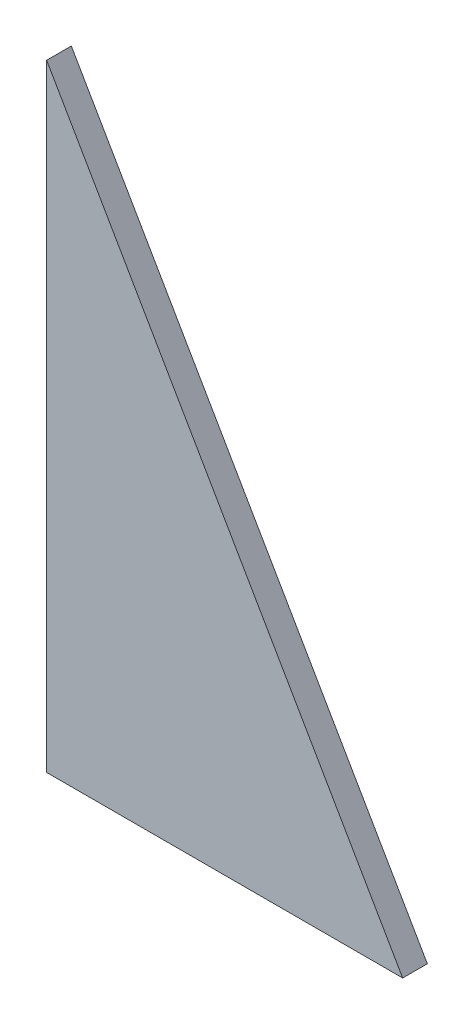
ISO-10303-21;
HEADER;
FILE_DESCRIPTION(('STEP AP214'),'2;1');
FILE_NAME('part.step','',(''),(''),'','','');
FILE_SCHEMA(('AUTOMOTIVE_DESIGN { 1 0 10303 214 1 1 1 1 }'));
ENDSEC;
DATA;
#1=APPLICATION_CONTEXT('core data for automotive mechanical design processes');
#2=APPLICATION_PROTOCOL_DEFINITION('international standard','automotive_design',2000,#1);
#3=PRODUCT_CONTEXT('',#1,'mechanical');
#4=PRODUCT('Part','Part','',(#3));
#5=PRODUCT_RELATED_PRODUCT_CATEGORY('part','',(#4));
#6=PRODUCT_DEFINITION_FORMATION('','',#4);
#7=PRODUCT_DEFINITION_CONTEXT('part definition',#1,'design');
#8=PRODUCT_DEFINITION('design','',#6,#7);
#9=PRODUCT_DEFINITION_SHAPE('','',#8);
#10=(LENGTH_UNIT() NAMED_UNIT(*) SI_UNIT(.MILLI.,.METRE.));
#11=(NAMED_UNIT(*) PLANE_ANGLE_UNIT() SI_UNIT($,.RADIAN.));
#12=(NAMED_UNIT(*) SI_UNIT($,.STERADIAN.) SOLID_ANGLE_UNIT());
#13=UNCERTAINTY_MEASURE_WITH_UNIT(LENGTH_MEASURE(1.E-05),#10,'distance_accuracy_value','');
#14=(GEOMETRIC_REPRESENTATION_CONTEXT(3) GLOBAL_UNCERTAINTY_ASSIGNED_CONTEXT((#13)) GLOBAL_UNIT_ASSIGNED_CONTEXT((#10,
#11,#12)) REPRESENTATION_CONTEXT('',''));
#15=CARTESIAN_POINT('',(0.,0.,0.));
#16=DIRECTION('',(0.,0.,1.));
#17=DIRECTION('',(1.,0.,0.));
#18=AXIS2_PLACEMENT_3D('',#15,#16,#17);
#19=CARTESIAN_POINT('',(0.,0.,2.54));
#20=DIRECTION('',(1.,0.,0.));
#21=DIRECTION('',(0.,0.,-1.));
#22=AXIS2_PLACEMENT_3D('',#19,#20,#21);
#23=PLANE('',#22);
#24=DIRECTION('',(0.,1.,0.));
#25=VECTOR('',#24,1.);
#26=CARTESIAN_POINT('',(0.,31.75,2.032));
#27=LINE('',#26,#25);
#28=CARTESIAN_POINT('',(0.,28.194,2.032));
#29=VERTEX_POINT('',#28);
#30=CARTESIAN_POINT('',(0.,35.306,2.032));
#31=VERTEX_POINT('',#30);
#32=EDGE_CURVE('E224',#29,#31,#27,.T.);
#33=ORIENTED_EDGE('',*,*,#32,.F.);
#34=DIRECTION('',(0.,0.,-1.));
#35=VECTOR('',#34,1.);
#36=CARTESIAN_POINT('',(0.,28.194,2.032));
#37=LINE('',#36,#35);
#38=CARTESIAN_POINT('',(0.,28.194,0.));
#39=VERTEX_POINT('',#38);
#40=EDGE_CURVE('E235',#29,#39,#37,.T.);
#41=ORIENTED_EDGE('',*,*,#40,.T.);
#42=DIRECTION('',(0.,-1.,0.));
#43=VECTOR('',#42,1.);
#44=CARTESIAN_POINT('',(0.,0.,0.));
#45=LINE('',#44,#43);
#46=CARTESIAN_POINT('',(0.,0.,0.));
#47=VERTEX_POINT('',#46);
#48=EDGE_CURVE('E222',#39,#47,#45,.T.);
#49=ORIENTED_EDGE('',*,*,#48,.T.);
#50=DIRECTION('',(0.,0.,-1.));
#51=VECTOR('',#50,1.);
#52=CARTESIAN_POINT('',(0.,0.,2.54));
#53=LINE('',#52,#51);
#54=CARTESIAN_POINT('',(0.,0.,2.54));
#55=VERTEX_POINT('',#54);
#56=EDGE_CURVE('E268',#55,#47,#53,.T.);
#57=ORIENTED_EDGE('',*,*,#56,.F.);
#58=DIRECTION('',(0.,-1.,0.));
#59=VECTOR('',#58,1.);
#60=CARTESIAN_POINT('',(0.,0.,2.54));
#61=LINE('',#60,#59);
#62=CARTESIAN_POINT('',(0.,63.5,2.54));
#63=VERTEX_POINT('',#62);
#64=EDGE_CURVE('E241',#63,#55,#61,.T.);
#65=ORIENTED_EDGE('',*,*,#64,.F.);
#66=DIRECTION('',(0.,0.,-1.));
#67=VECTOR('',#66,1.);
#68=CARTESIAN_POINT('',(0.,63.5,2.54));
#69=LINE('',#68,#67);
#70=CARTESIAN_POINT('',(0.,63.5,0.));
#71=VERTEX_POINT('',#70);
#72=EDGE_CURVE('E252',#63,#71,#69,.T.);
#73=ORIENTED_EDGE('',*,*,#72,.T.);
#74=CARTESIAN_POINT('',(0.,35.306,0.));
#75=VERTEX_POINT('',#74);
#76=EDGE_CURVE('E253',#71,#75,#45,.T.);
#77=ORIENTED_EDGE('',*,*,#76,.T.);
#78=DIRECTION('',(0.,0.,-1.));
#79=VECTOR('',#78,1.);
#80=CARTESIAN_POINT('',(0.,35.306,2.032));
#81=LINE('',#80,#79);
#82=EDGE_CURVE('E237',#31,#75,#81,.T.);
#83=ORIENTED_EDGE('',*,*,#82,.F.);
#84=EDGE_LOOP('',(#33,#41,#49,#57,#65,#73,#77,#83));
#85=FACE_BOUND('',#84,.T.);
#86=ADVANCED_FACE('F38',(#85),#23,.F.);
#87=CARTESIAN_POINT('',(0.,0.,2.54));
#88=DIRECTION('',(0.,1.,0.));
#89=DIRECTION('',(0.,0.,1.));
#90=AXIS2_PLACEMENT_3D('',#87,#88,#89);
#91=PLANE('',#90);
#92=DIRECTION('',(1.,0.,0.));
#93=VECTOR('',#92,1.);
#94=CARTESIAN_POINT('',(0.,0.,0.));
#95=LINE('',#94,#93);
#96=CARTESIAN_POINT('',(36.6522,0.,0.));
#97=VERTEX_POINT('',#96);
#98=EDGE_CURVE('E257',#47,#97,#95,.T.);
#99=ORIENTED_EDGE('',*,*,#98,.T.);
#100=DIRECTION('',(0.,0.,-1.));
#101=VECTOR('',#100,1.);
#102=CARTESIAN_POINT('',(36.6522,0.,2.54));
#103=LINE('',#102,#101);
#104=CARTESIAN_POINT('',(36.6522,0.,2.54));
#105=VERTEX_POINT('',#104);
#106=EDGE_CURVE('E265',#105,#97,#103,.T.);
#107=ORIENTED_EDGE('',*,*,#106,.F.);
#108=DIRECTION('',(1.,0.,0.));
#109=VECTOR('',#108,1.);
#110=CARTESIAN_POINT('',(0.,0.,2.54));
#111=LINE('',#110,#109);
#112=EDGE_CURVE('E245',#55,#105,#111,.T.);
#113=ORIENTED_EDGE('',*,*,#112,.F.);
#114=ORIENTED_EDGE('',*,*,#56,.T.);
#115=EDGE_LOOP('',(#99,#107,#113,#114));
#116=FACE_BOUND('',#115,.T.);
#117=ADVANCED_FACE('F433',(#116),#91,.F.);
#118=CARTESIAN_POINT('',(0.,63.5,2.54));
#119=DIRECTION('',(-0.866081752896378,-0.49990238777179,0.));
#120=DIRECTION('',(0.49990238777179,-0.866081752896378,0.));
#121=AXIS2_PLACEMENT_3D('',#118,#119,#120);
#122=PLANE('',#121);
#123=DIRECTION('',(-0.49990238777179,0.866081752896378,0.));
#124=VECTOR('',#123,1.);
#125=CARTESIAN_POINT('',(0.,63.5,0.));
#126=LINE('',#125,#124);
#127=EDGE_CURVE('E246',#97,#71,#126,.T.);
#128=ORIENTED_EDGE('',*,*,#127,.T.);
#129=ORIENTED_EDGE('',*,*,#72,.F.);
#130=DIRECTION('',(-0.49990238777179,0.866081752896378,0.));
#131=VECTOR('',#130,1.);
#132=CARTESIAN_POINT('',(0.,63.5,2.54));
#133=LINE('',#132,#131);
#134=EDGE_CURVE('E249',#105,#63,#133,.T.);
#135=ORIENTED_EDGE('',*,*,#134,.F.);
#136=ORIENTED_EDGE('',*,*,#106,.T.);
#137=EDGE_LOOP('',(#128,#129,#135,#136));
#138=FACE_BOUND('',#137,.T.);
#139=ADVANCED_FACE('F437',(#138),#122,.F.);
#140=CARTESIAN_POINT('',(0.,0.,2.54));
#141=DIRECTION('',(0.,0.,-1.));
#142=DIRECTION('',(-1.,0.,0.));
#143=AXIS2_PLACEMENT_3D('',#140,#141,#142);
#144=PLANE('',#143);
#145=ORIENTED_EDGE('',*,*,#64,.T.);
#146=ORIENTED_EDGE('',*,*,#112,.T.);
#147=ORIENTED_EDGE('',*,*,#134,.T.);
#148=EDGE_LOOP('',(#145,#146,#147));
#149=FACE_BOUND('',#148,.T.);
#150=ADVANCED_FACE('F443',(#149),#144,.F.);
#151=CARTESIAN_POINT('',(0.,0.,0.));
#152=DIRECTION('',(0.,0.,-1.));
#153=DIRECTION('',(-1.,0.,0.));
#154=AXIS2_PLACEMENT_3D('',#151,#152,#153);
#155=PLANE('',#154);
#156=DIRECTION('',(0.,1.,0.));
#157=VECTOR('',#156,1.);
#158=CARTESIAN_POINT('',(2.54,31.75,0.));
#159=LINE('',#158,#157);
#160=CARTESIAN_POINT('',(2.54,22.5425,0.));
#161=VERTEX_POINT('',#160);
#162=CARTESIAN_POINT('',(2.54,28.194,0.));
#163=VERTEX_POINT('',#162);
#164=EDGE_CURVE('E194',#161,#163,#159,.T.);
#165=ORIENTED_EDGE('',*,*,#164,.F.);
#166=CARTESIAN_POINT('',(4.1275,22.5425,0.));
#167=DIRECTION('',(0.,0.,-1.));
#168=DIRECTION('',(-1.,0.,0.));
#169=AXIS2_PLACEMENT_3D('',#166,#167,#168);
#170=CIRCLE('',#169,1.5875);
#171=CARTESIAN_POINT('',(4.1275,20.955,0.));
#172=VERTEX_POINT('',#171);
#173=EDGE_CURVE('E330',#161,#172,#170,.F.);
#174=ORIENTED_EDGE('',*,*,#173,.T.);
#175=DIRECTION('',(-1.,0.,0.));
#176=VECTOR('',#175,1.);
#177=CARTESIAN_POINT('',(2.54,20.955,0.));
#178=LINE('',#177,#176);
#179=CARTESIAN_POINT('',(16.5666651598498,20.955,0.));
#180=VERTEX_POINT('',#179);
#181=EDGE_CURVE('E353',#180,#172,#178,.T.);
#182=ORIENTED_EDGE('',*,*,#181,.F.);
#183=CARTESIAN_POINT('',(16.5666651598498,22.5425,0.));
#184=DIRECTION('',(0.,0.,-1.));
#185=DIRECTION('',(-1.,0.,0.));
#186=AXIS2_PLACEMENT_3D('',#183,#184,#185);
#187=CIRCLE('',#186,1.5875);
#188=CARTESIAN_POINT('',(17.9415699425728,23.3360950405877,0.));
#189=VERTEX_POINT('',#188);
#190=EDGE_CURVE('E338',#180,#189,#187,.F.);
#191=ORIENTED_EDGE('',*,*,#190,.T.);
#192=DIRECTION('',(0.49990238777179,-0.866081752896379,0.));
#193=VECTOR('',#192,1.);
#194=CARTESIAN_POINT('',(6.85419,42.545,0.));
#195=LINE('',#194,#193);
#196=CARTESIAN_POINT('',(7.31243194257277,41.7510950405877,0.));
#197=VERTEX_POINT('',#196);
#198=EDGE_CURVE('E348',#197,#189,#195,.T.);
#199=ORIENTED_EDGE('',*,*,#198,.F.);
#200=CARTESIAN_POINT('',(5.93752715984977,40.9575,0.));
#201=DIRECTION('',(0.,0.,-1.));
#202=DIRECTION('',(-1.,0.,0.));
#203=AXIS2_PLACEMENT_3D('',#200,#201,#202);
#204=CIRCLE('',#203,1.5875);
#205=CARTESIAN_POINT('',(5.93752715984977,42.545,0.));
#206=VERTEX_POINT('',#205);
#207=EDGE_CURVE('E47',#197,#206,#204,.F.);
#208=ORIENTED_EDGE('',*,*,#207,.T.);
#209=DIRECTION('',(1.,0.,0.));
#210=VECTOR('',#209,1.);
#211=CARTESIAN_POINT('',(2.54,42.545,0.));
#212=LINE('',#211,#210);
#213=CARTESIAN_POINT('',(4.1275,42.545,0.));
#214=VERTEX_POINT('',#213);
#215=EDGE_CURVE('E347',#214,#206,#212,.T.);
#216=ORIENTED_EDGE('',*,*,#215,.F.);
#217=CARTESIAN_POINT('',(4.1275,40.9575,0.));
#218=DIRECTION('',(0.,0.,-1.));
#219=DIRECTION('',(-1.,0.,0.));
#220=AXIS2_PLACEMENT_3D('',#217,#218,#219);
#221=CIRCLE('',#220,1.5875);
#222=CARTESIAN_POINT('',(2.54,40.9575,0.));
#223=VERTEX_POINT('',#222);
#224=EDGE_CURVE('E11',#214,#223,#221,.F.);
#225=ORIENTED_EDGE('',*,*,#224,.T.);
#226=CARTESIAN_POINT('',(2.54,35.306,0.));
#227=VERTEX_POINT('',#226);
#228=EDGE_CURVE('E204',#227,#223,#159,.T.);
#229=ORIENTED_EDGE('',*,*,#228,.F.);
#230=DIRECTION('',(1.,0.,0.));
#231=VECTOR('',#230,1.);
#232=CARTESIAN_POINT('',(0.,35.306,0.));
#233=LINE('',#232,#231);
#234=EDGE_CURVE('E217',#75,#227,#233,.T.);
#235=ORIENTED_EDGE('',*,*,#234,.F.);
#236=ORIENTED_EDGE('',*,*,#76,.F.);
#237=ORIENTED_EDGE('',*,*,#127,.F.);
#238=ORIENTED_EDGE('',*,*,#98,.F.);
#239=ORIENTED_EDGE('',*,*,#48,.F.);
#240=DIRECTION('',(-1.,0.,0.));
#241=VECTOR('',#240,1.);
#242=CARTESIAN_POINT('',(0.,28.194,0.));
#243=LINE('',#242,#241);
#244=EDGE_CURVE('E210',#163,#39,#243,.T.);
#245=ORIENTED_EDGE('',*,*,#244,.F.);
#246=EDGE_LOOP('',(#165,#174,#182,#191,#199,#208,#216,#225,#229,#235,#236,#237,#238,#239,#245));
#247=FACE_BOUND('',#246,.T.);
#248=ADVANCED_FACE('F220',(#247),#155,.T.);
#249=CARTESIAN_POINT('',(0.,28.194,2.032));
#250=DIRECTION('',(0.,-1.,0.));
#251=DIRECTION('',(0.,0.,-1.));
#252=AXIS2_PLACEMENT_3D('',#249,#250,#251);
#253=PLANE('',#252);
#254=DIRECTION('',(-1.,0.,0.));
#255=VECTOR('',#254,1.);
#256=CARTESIAN_POINT('',(0.,28.194,2.032));
#257=LINE('',#256,#255);
#258=CARTESIAN_POINT('',(9.08049999999999,28.194,2.032));
#259=VERTEX_POINT('',#258);
#260=EDGE_CURVE('E240',#259,#29,#257,.T.);
#261=ORIENTED_EDGE('',*,*,#260,.F.);
#262=DIRECTION('',(0.,0.,-1.));
#263=VECTOR('',#262,1.);
#264=CARTESIAN_POINT('',(9.08049999999999,28.194,0.9144));
#265=LINE('',#264,#263);
#266=CARTESIAN_POINT('',(9.08049999999999,28.194,0.9144));
#267=VERTEX_POINT('',#266);
#268=EDGE_CURVE('E312',#259,#267,#265,.T.);
#269=ORIENTED_EDGE('',*,*,#268,.T.);
#270=DIRECTION('',(-1.,0.,0.));
#271=VECTOR('',#270,1.);
#272=CARTESIAN_POINT('',(0.,28.194,0.9144));
#273=LINE('',#272,#271);
#274=CARTESIAN_POINT('',(2.54,28.194,0.9144));
#275=VERTEX_POINT('',#274);
#276=EDGE_CURVE('E214',#267,#275,#273,.T.);
#277=ORIENTED_EDGE('',*,*,#276,.T.);
#278=DIRECTION('',(0.,0.,-1.));
#279=VECTOR('',#278,1.);
#280=CARTESIAN_POINT('',(2.54,28.194,2.032));
#281=LINE('',#280,#279);
#282=EDGE_CURVE('E198',#275,#163,#281,.T.);
#283=ORIENTED_EDGE('',*,*,#282,.T.);
#284=ORIENTED_EDGE('',*,*,#244,.T.);
#285=ORIENTED_EDGE('',*,*,#40,.F.);
#286=EDGE_LOOP('',(#261,#269,#277,#283,#284,#285));
#287=FACE_BOUND('',#286,.T.);
#288=ADVANCED_FACE('F208',(#287),#253,.F.);
#289=CARTESIAN_POINT('',(10.668,35.306,2.032));
#290=DIRECTION('',(1.,0.,0.));
#291=DIRECTION('',(0.,1.,0.));
#292=AXIS2_PLACEMENT_3D('',#289,#290,#291);
#293=PLANE('',#292);
#294=DIRECTION('',(0.,-1.,0.));
#295=VECTOR('',#294,1.);
#296=CARTESIAN_POINT('',(10.668,35.306,2.032));
#297=LINE('',#296,#295);
#298=CARTESIAN_POINT('',(10.668,33.7185,2.032));
#299=VERTEX_POINT('',#298);
#300=CARTESIAN_POINT('',(10.668,29.7815,2.032));
#301=VERTEX_POINT('',#300);
#302=EDGE_CURVE('E371',#299,#301,#297,.T.);
#303=ORIENTED_EDGE('',*,*,#302,.F.);
#304=DIRECTION('',(0.,0.,-1.));
#305=VECTOR('',#304,1.);
#306=CARTESIAN_POINT('',(10.668,33.7185,0.9144));
#307=LINE('',#306,#305);
#308=CARTESIAN_POINT('',(10.668,33.7185,0.9144));
#309=VERTEX_POINT('',#308);
#310=EDGE_CURVE('E302',#299,#309,#307,.T.);
#311=ORIENTED_EDGE('',*,*,#310,.T.);
#312=DIRECTION('',(0.,-1.,0.));
#313=VECTOR('',#312,1.);
#314=CARTESIAN_POINT('',(10.668,35.306,0.9144));
#315=LINE('',#314,#313);
#316=CARTESIAN_POINT('',(10.668,29.7815,0.9144));
#317=VERTEX_POINT('',#316);
#318=EDGE_CURVE('E362',#309,#317,#315,.T.);
#319=ORIENTED_EDGE('',*,*,#318,.T.);
#320=DIRECTION('',(0.,0.,-1.));
#321=VECTOR('',#320,1.);
#322=CARTESIAN_POINT('',(10.668,29.7815,2.032));
#323=LINE('',#322,#321);
#324=EDGE_CURVE('E299',#317,#301,#323,.F.);
#325=ORIENTED_EDGE('',*,*,#324,.T.);
#326=EDGE_LOOP('',(#303,#311,#319,#325));
#327=FACE_BOUND('',#326,.T.);
#328=ADVANCED_FACE('F452',(#327),#293,.F.);
#329=CARTESIAN_POINT('',(0.,35.306,2.032));
#330=DIRECTION('',(0.,1.,0.));
#331=DIRECTION('',(0.,0.,1.));
#332=AXIS2_PLACEMENT_3D('',#329,#330,#331);
#333=PLANE('',#332);
#334=DIRECTION('',(1.,0.,0.));
#335=VECTOR('',#334,1.);
#336=CARTESIAN_POINT('',(0.,35.306,0.9144));
#337=LINE('',#336,#335);
#338=CARTESIAN_POINT('',(2.54,35.306,0.9144));
#339=VERTEX_POINT('',#338);
#340=CARTESIAN_POINT('',(9.08049999999999,35.306,0.9144));
#341=VERTEX_POINT('',#340);
#342=EDGE_CURVE('E272',#339,#341,#337,.T.);
#343=ORIENTED_EDGE('',*,*,#342,.T.);
#344=DIRECTION('',(0.,0.,-1.));
#345=VECTOR('',#344,1.);
#346=CARTESIAN_POINT('',(9.08049999999999,35.306,2.032));
#347=LINE('',#346,#345);
#348=CARTESIAN_POINT('',(9.08049999999999,35.306,2.032));
#349=VERTEX_POINT('',#348);
#350=EDGE_CURVE('E305',#341,#349,#347,.F.);
#351=ORIENTED_EDGE('',*,*,#350,.T.);
#352=DIRECTION('',(1.,0.,0.));
#353=VECTOR('',#352,1.);
#354=CARTESIAN_POINT('',(0.,35.306,2.032));
#355=LINE('',#354,#353);
#356=EDGE_CURVE('E228',#31,#349,#355,.T.);
#357=ORIENTED_EDGE('',*,*,#356,.F.);
#358=ORIENTED_EDGE('',*,*,#82,.T.);
#359=ORIENTED_EDGE('',*,*,#234,.T.);
#360=DIRECTION('',(0.,0.,1.));
#361=VECTOR('',#360,1.);
#362=CARTESIAN_POINT('',(2.54,35.306,2.032));
#363=LINE('',#362,#361);
#364=EDGE_CURVE('E276',#227,#339,#363,.T.);
#365=ORIENTED_EDGE('',*,*,#364,.T.);
#366=EDGE_LOOP('',(#343,#351,#357,#358,#359,#365));
#367=FACE_BOUND('',#366,.T.);
#368=ADVANCED_FACE('F386',(#367),#333,.F.);
#369=CARTESIAN_POINT('',(0.,28.194,2.032));
#370=DIRECTION('',(0.,0.,1.));
#371=DIRECTION('',(1.,0.,0.));
#372=AXIS2_PLACEMENT_3D('',#369,#370,#371);
#373=PLANE('',#372);
#374=ORIENTED_EDGE('',*,*,#356,.T.);
#375=CARTESIAN_POINT('',(9.08049999999999,33.7185,2.032));
#376=DIRECTION('',(0.,0.,1.));
#377=DIRECTION('',(1.,0.,0.));
#378=AXIS2_PLACEMENT_3D('',#375,#376,#377);
#379=CIRCLE('',#378,1.5875);
#380=EDGE_CURVE('E310',#349,#299,#379,.F.);
#381=ORIENTED_EDGE('',*,*,#380,.T.);
#382=ORIENTED_EDGE('',*,*,#302,.T.);
#383=CARTESIAN_POINT('',(9.08049999999999,29.7815,2.032));
#384=DIRECTION('',(0.,0.,1.));
#385=DIRECTION('',(1.,0.,0.));
#386=AXIS2_PLACEMENT_3D('',#383,#384,#385);
#387=CIRCLE('',#386,1.5875);
#388=EDGE_CURVE('E307',#301,#259,#387,.F.);
#389=ORIENTED_EDGE('',*,*,#388,.T.);
#390=ORIENTED_EDGE('',*,*,#260,.T.);
#391=ORIENTED_EDGE('',*,*,#32,.T.);
#392=EDGE_LOOP('',(#374,#381,#382,#389,#390,#391));
#393=FACE_BOUND('',#392,.T.);
#394=ADVANCED_FACE('F376',(#393),#373,.F.);
#395=CARTESIAN_POINT('',(2.54,31.75,0.9144));
#396=DIRECTION('',(-1.,0.,0.));
#397=DIRECTION('',(0.,-1.,0.));
#398=AXIS2_PLACEMENT_3D('',#395,#396,#397);
#399=PLANE('',#398);
#400=DIRECTION('',(0.,1.,0.));
#401=VECTOR('',#400,1.);
#402=CARTESIAN_POINT('',(2.54,42.545,0.9144));
#403=LINE('',#402,#401);
#404=CARTESIAN_POINT('',(2.54,22.5425,0.9144));
#405=VERTEX_POINT('',#404);
#406=EDGE_CURVE('E344',#405,#275,#403,.T.);
#407=ORIENTED_EDGE('',*,*,#406,.F.);
#408=DIRECTION('',(0.,0.,-1.));
#409=VECTOR('',#408,1.);
#410=CARTESIAN_POINT('',(2.54,22.5425,0.));
#411=LINE('',#410,#409);
#412=EDGE_CURVE('E200',#405,#161,#411,.T.);
#413=ORIENTED_EDGE('',*,*,#412,.T.);
#414=ORIENTED_EDGE('',*,*,#164,.T.);
#415=ORIENTED_EDGE('',*,*,#282,.F.);
#416=EDGE_LOOP('',(#407,#413,#414,#415));
#417=FACE_BOUND('',#416,.T.);
#418=ADVANCED_FACE('F197',(#417),#399,.F.);
#419=ORIENTED_EDGE('',*,*,#228,.T.);
#420=DIRECTION('',(0.,0.,-1.));
#421=VECTOR('',#420,1.);
#422=CARTESIAN_POINT('',(2.54,40.9575,0.9144));
#423=LINE('',#422,#421);
#424=CARTESIAN_POINT('',(2.54,40.9575,0.9144));
#425=VERTEX_POINT('',#424);
#426=EDGE_CURVE('E327',#223,#425,#423,.F.);
#427=ORIENTED_EDGE('',*,*,#426,.T.);
#428=EDGE_CURVE('E203',#339,#425,#403,.T.);
#429=ORIENTED_EDGE('',*,*,#428,.F.);
#430=ORIENTED_EDGE('',*,*,#364,.F.);
#431=EDGE_LOOP('',(#419,#427,#429,#430));
#432=FACE_BOUND('',#431,.T.);
#433=ADVANCED_FACE('F466',(#432),#399,.F.);
#434=CARTESIAN_POINT('',(2.54,20.955,0.9144));
#435=DIRECTION('',(0.,0.,1.));
#436=DIRECTION('',(1.,0.,0.));
#437=AXIS2_PLACEMENT_3D('',#434,#435,#436);
#438=PLANE('',#437);
#439=DIRECTION('',(-1.,0.,0.));
#440=VECTOR('',#439,1.);
#441=CARTESIAN_POINT('',(2.54,20.955,0.9144));
#442=LINE('',#441,#440);
#443=CARTESIAN_POINT('',(16.5666651598498,20.955,0.9144));
#444=VERTEX_POINT('',#443);
#445=CARTESIAN_POINT('',(4.1275,20.955,0.9144));
#446=VERTEX_POINT('',#445);
#447=EDGE_CURVE('E356',#444,#446,#442,.T.);
#448=ORIENTED_EDGE('',*,*,#447,.T.);
#449=CARTESIAN_POINT('',(4.1275,22.5425,0.9144));
#450=DIRECTION('',(0.,0.,1.));
#451=DIRECTION('',(1.,0.,0.));
#452=AXIS2_PLACEMENT_3D('',#449,#450,#451);
#453=CIRCLE('',#452,1.5875);
#454=EDGE_CURVE('E296',#446,#405,#453,.F.);
#455=ORIENTED_EDGE('',*,*,#454,.T.);
#456=ORIENTED_EDGE('',*,*,#406,.T.);
#457=ORIENTED_EDGE('',*,*,#276,.F.);
#458=CARTESIAN_POINT('',(9.08049999999999,29.7815,0.9144));
#459=DIRECTION('',(0.,0.,1.));
#460=DIRECTION('',(1.,0.,0.));
#461=AXIS2_PLACEMENT_3D('',#458,#459,#460);
#462=CIRCLE('',#461,1.5875);
#463=EDGE_CURVE('E335',#267,#317,#462,.T.);
#464=ORIENTED_EDGE('',*,*,#463,.T.);
#465=ORIENTED_EDGE('',*,*,#318,.F.);
#466=CARTESIAN_POINT('',(9.08049999999999,33.7185,0.9144));
#467=DIRECTION('',(0.,0.,1.));
#468=DIRECTION('',(1.,0.,0.));
#469=AXIS2_PLACEMENT_3D('',#466,#467,#468);
#470=CIRCLE('',#469,1.5875);
#471=EDGE_CURVE('E333',#309,#341,#470,.T.);
#472=ORIENTED_EDGE('',*,*,#471,.T.);
#473=ORIENTED_EDGE('',*,*,#342,.F.);
#474=ORIENTED_EDGE('',*,*,#428,.T.);
#475=CARTESIAN_POINT('',(4.1275,40.9575,0.9144));
#476=DIRECTION('',(0.,0.,1.));
#477=DIRECTION('',(1.,0.,0.));
#478=AXIS2_PLACEMENT_3D('',#475,#476,#477);
#479=CIRCLE('',#478,1.5875);
#480=CARTESIAN_POINT('',(4.1275,42.545,0.9144));
#481=VERTEX_POINT('',#480);
#482=EDGE_CURVE('E288',#425,#481,#479,.F.);
#483=ORIENTED_EDGE('',*,*,#482,.T.);
#484=DIRECTION('',(1.,0.,0.));
#485=VECTOR('',#484,1.);
#486=CARTESIAN_POINT('',(2.54,42.545,0.9144));
#487=LINE('',#486,#485);
#488=CARTESIAN_POINT('',(5.93752715984977,42.545,0.9144));
#489=VERTEX_POINT('',#488);
#490=EDGE_CURVE('E341',#481,#489,#487,.T.);
#491=ORIENTED_EDGE('',*,*,#490,.T.);
#492=CARTESIAN_POINT('',(5.93752715984977,40.9575,0.9144));
#493=DIRECTION('',(0.,0.,1.));
#494=DIRECTION('',(1.,0.,0.));
#495=AXIS2_PLACEMENT_3D('',#492,#493,#494);
#496=CIRCLE('',#495,1.5875);
#497=CARTESIAN_POINT('',(7.31243194257277,41.7510950405877,0.9144));
#498=VERTEX_POINT('',#497);
#499=EDGE_CURVE('E291',#489,#498,#496,.F.);
#500=ORIENTED_EDGE('',*,*,#499,.T.);
#501=DIRECTION('',(0.49990238777179,-0.866081752896379,0.));
#502=VECTOR('',#501,1.);
#503=CARTESIAN_POINT('',(6.85419,42.545,0.9144));
#504=LINE('',#503,#502);
#505=CARTESIAN_POINT('',(17.9415699425728,23.3360950405877,0.9144));
#506=VERTEX_POINT('',#505);
#507=EDGE_CURVE('E343',#498,#506,#504,.T.);
#508=ORIENTED_EDGE('',*,*,#507,.T.);
#509=CARTESIAN_POINT('',(16.5666651598498,22.5425,0.9144));
#510=DIRECTION('',(0.,0.,1.));
#511=DIRECTION('',(1.,0.,0.));
#512=AXIS2_PLACEMENT_3D('',#509,#510,#511);
#513=CIRCLE('',#512,1.5875);
#514=EDGE_CURVE('E294',#506,#444,#513,.F.);
#515=ORIENTED_EDGE('',*,*,#514,.T.);
#516=EDGE_LOOP('',(#448,#455,#456,#457,#464,#465,#472,#473,#474,#483,#491,#500,#508,#515));
#517=FACE_BOUND('',#516,.T.);
#518=ADVANCED_FACE('F402',(#517),#438,.F.);
#519=CARTESIAN_POINT('',(2.54,20.955,0.9144));
#520=DIRECTION('',(0.,-1.,0.));
#521=DIRECTION('',(1.,0.,0.));
#522=AXIS2_PLACEMENT_3D('',#519,#520,#521);
#523=PLANE('',#522);
#524=ORIENTED_EDGE('',*,*,#181,.T.);
#525=DIRECTION('',(0.,0.,-1.));
#526=VECTOR('',#525,1.);
#527=CARTESIAN_POINT('',(4.1275,20.955,0.9144));
#528=LINE('',#527,#526);
#529=EDGE_CURVE('E285',#172,#446,#528,.F.);
#530=ORIENTED_EDGE('',*,*,#529,.T.);
#531=ORIENTED_EDGE('',*,*,#447,.F.);
#532=DIRECTION('',(0.,0.,-1.));
#533=VECTOR('',#532,1.);
#534=CARTESIAN_POINT('',(16.5666651598498,20.955,0.));
#535=LINE('',#534,#533);
#536=EDGE_CURVE('E282',#444,#180,#535,.T.);
#537=ORIENTED_EDGE('',*,*,#536,.T.);
#538=EDGE_LOOP('',(#524,#530,#531,#537));
#539=FACE_BOUND('',#538,.T.);
#540=ADVANCED_FACE('F413',(#539),#523,.F.);
#541=CARTESIAN_POINT('',(6.85419,42.545,0.9144));
#542=DIRECTION('',(0.866081752896379,0.49990238777179,0.));
#543=DIRECTION('',(-0.499902387771789,0.866081752896378,0.));
#544=AXIS2_PLACEMENT_3D('',#541,#542,#543);
#545=PLANE('',#544);
#546=ORIENTED_EDGE('',*,*,#198,.T.);
#547=DIRECTION('',(0.,0.,-1.));
#548=VECTOR('',#547,1.);
#549=CARTESIAN_POINT('',(17.9415699425728,23.3360950405877,0.9144));
#550=LINE('',#549,#548);
#551=EDGE_CURVE('E318',#189,#506,#550,.F.);
#552=ORIENTED_EDGE('',*,*,#551,.T.);
#553=ORIENTED_EDGE('',*,*,#507,.F.);
#554=DIRECTION('',(0.,0.,-1.));
#555=VECTOR('',#554,1.);
#556=CARTESIAN_POINT('',(7.31243194257277,41.7510950405877,0.));
#557=LINE('',#556,#555);
#558=EDGE_CURVE('E315',#498,#197,#557,.T.);
#559=ORIENTED_EDGE('',*,*,#558,.T.);
#560=EDGE_LOOP('',(#546,#552,#553,#559));
#561=FACE_BOUND('',#560,.T.);
#562=ADVANCED_FACE('F429',(#561),#545,.F.);
#563=CARTESIAN_POINT('',(2.54,42.545,0.9144));
#564=DIRECTION('',(0.,1.,0.));
#565=DIRECTION('',(0.,0.,1.));
#566=AXIS2_PLACEMENT_3D('',#563,#564,#565);
#567=PLANE('',#566);
#568=ORIENTED_EDGE('',*,*,#215,.T.);
#569=DIRECTION('',(0.,0.,-1.));
#570=VECTOR('',#569,1.);
#571=CARTESIAN_POINT('',(5.93752715984977,42.545,0.9144));
#572=LINE('',#571,#570);
#573=EDGE_CURVE('E324',#206,#489,#572,.F.);
#574=ORIENTED_EDGE('',*,*,#573,.T.);
#575=ORIENTED_EDGE('',*,*,#490,.F.);
#576=DIRECTION('',(0.,0.,-1.));
#577=VECTOR('',#576,1.);
#578=CARTESIAN_POINT('',(4.1275,42.545,0.));
#579=LINE('',#578,#577);
#580=EDGE_CURVE('E320',#481,#214,#579,.T.);
#581=ORIENTED_EDGE('',*,*,#580,.T.);
#582=EDGE_LOOP('',(#568,#574,#575,#581));
#583=FACE_BOUND('',#582,.T.);
#584=ADVANCED_FACE('F420',(#583),#567,.F.);
#585=CARTESIAN_POINT('',(4.1275,22.5425,0.9144));
#586=DIRECTION('',(0.,0.,1.));
#587=DIRECTION('',(1.,0.,0.));
#588=AXIS2_PLACEMENT_3D('',#585,#586,#587);
#589=CYLINDRICAL_SURFACE('',#588,1.5875);
#590=ORIENTED_EDGE('',*,*,#454,.F.);
#591=ORIENTED_EDGE('',*,*,#529,.F.);
#592=ORIENTED_EDGE('',*,*,#173,.F.);
#593=ORIENTED_EDGE('',*,*,#412,.F.);
#594=EDGE_LOOP('',(#590,#591,#592,#593));
#595=FACE_BOUND('',#594,.T.);
#596=ADVANCED_FACE('F417',(#595),#589,.F.);
#597=CARTESIAN_POINT('',(9.08049999999999,33.7185,2.032));
#598=DIRECTION('',(0.,0.,1.));
#599=DIRECTION('',(1.,0.,0.));
#600=AXIS2_PLACEMENT_3D('',#597,#598,#599);
#601=CYLINDRICAL_SURFACE('',#600,1.5875);
#602=ORIENTED_EDGE('',*,*,#380,.F.);
#603=ORIENTED_EDGE('',*,*,#350,.F.);
#604=ORIENTED_EDGE('',*,*,#471,.F.);
#605=ORIENTED_EDGE('',*,*,#310,.F.);
#606=EDGE_LOOP('',(#602,#603,#604,#605));
#607=FACE_BOUND('',#606,.T.);
#608=ADVANCED_FACE('F419',(#607),#601,.F.);
#609=CARTESIAN_POINT('',(9.08049999999999,29.7815,2.032));
#610=DIRECTION('',(0.,0.,1.));
#611=DIRECTION('',(1.,0.,0.));
#612=AXIS2_PLACEMENT_3D('',#609,#610,#611);
#613=CYLINDRICAL_SURFACE('',#612,1.5875);
#614=ORIENTED_EDGE('',*,*,#388,.F.);
#615=ORIENTED_EDGE('',*,*,#324,.F.);
#616=ORIENTED_EDGE('',*,*,#463,.F.);
#617=ORIENTED_EDGE('',*,*,#268,.F.);
#618=EDGE_LOOP('',(#614,#615,#616,#617));
#619=FACE_BOUND('',#618,.T.);
#620=ADVANCED_FACE('F426',(#619),#613,.F.);
#621=CARTESIAN_POINT('',(16.5666651598498,22.5425,0.9144));
#622=DIRECTION('',(0.,0.,1.));
#623=DIRECTION('',(1.,0.,0.));
#624=AXIS2_PLACEMENT_3D('',#621,#622,#623);
#625=CYLINDRICAL_SURFACE('',#624,1.5875);
#626=ORIENTED_EDGE('',*,*,#514,.F.);
#627=ORIENTED_EDGE('',*,*,#551,.F.);
#628=ORIENTED_EDGE('',*,*,#190,.F.);
#629=ORIENTED_EDGE('',*,*,#536,.F.);
#630=EDGE_LOOP('',(#626,#627,#628,#629));
#631=FACE_BOUND('',#630,.T.);
#632=ADVANCED_FACE('F410',(#631),#625,.F.);
#633=CARTESIAN_POINT('',(5.93752715984977,40.9575,0.9144));
#634=DIRECTION('',(0.,0.,1.));
#635=DIRECTION('',(1.,0.,0.));
#636=AXIS2_PLACEMENT_3D('',#633,#634,#635);
#637=CYLINDRICAL_SURFACE('',#636,1.5875);
#638=ORIENTED_EDGE('',*,*,#499,.F.);
#639=ORIENTED_EDGE('',*,*,#573,.F.);
#640=ORIENTED_EDGE('',*,*,#207,.F.);
#641=ORIENTED_EDGE('',*,*,#558,.F.);
#642=EDGE_LOOP('',(#638,#639,#640,#641));
#643=FACE_BOUND('',#642,.T.);
#644=ADVANCED_FACE('F582',(#643),#637,.F.);
#645=CARTESIAN_POINT('',(4.1275,40.9575,0.9144));
#646=DIRECTION('',(0.,0.,1.));
#647=DIRECTION('',(1.,0.,0.));
#648=AXIS2_PLACEMENT_3D('',#645,#646,#647);
#649=CYLINDRICAL_SURFACE('',#648,1.5875);
#650=ORIENTED_EDGE('',*,*,#482,.F.);
#651=ORIENTED_EDGE('',*,*,#426,.F.);
#652=ORIENTED_EDGE('',*,*,#224,.F.);
#653=ORIENTED_EDGE('',*,*,#580,.F.);
#654=EDGE_LOOP('',(#650,#651,#652,#653));
#655=FACE_BOUND('',#654,.T.);
#656=ADVANCED_FACE('F40',(#655),#649,.F.);
#657=CLOSED_SHELL('',(#86,#117,#139,#150,#248,#288,#328,#368,#394,#418,#433,#518,#540,#562,#584,
#596,#608,#620,#632,#644,#656));
#658=MANIFOLD_SOLID_BREP('B2',#657);
#659=ADVANCED_BREP_SHAPE_REPRESENTATION('',(#18,#658),#14);
#660=SHAPE_DEFINITION_REPRESENTATION(#9,#659);
ENDSEC;
END-ISO-10303-21;
